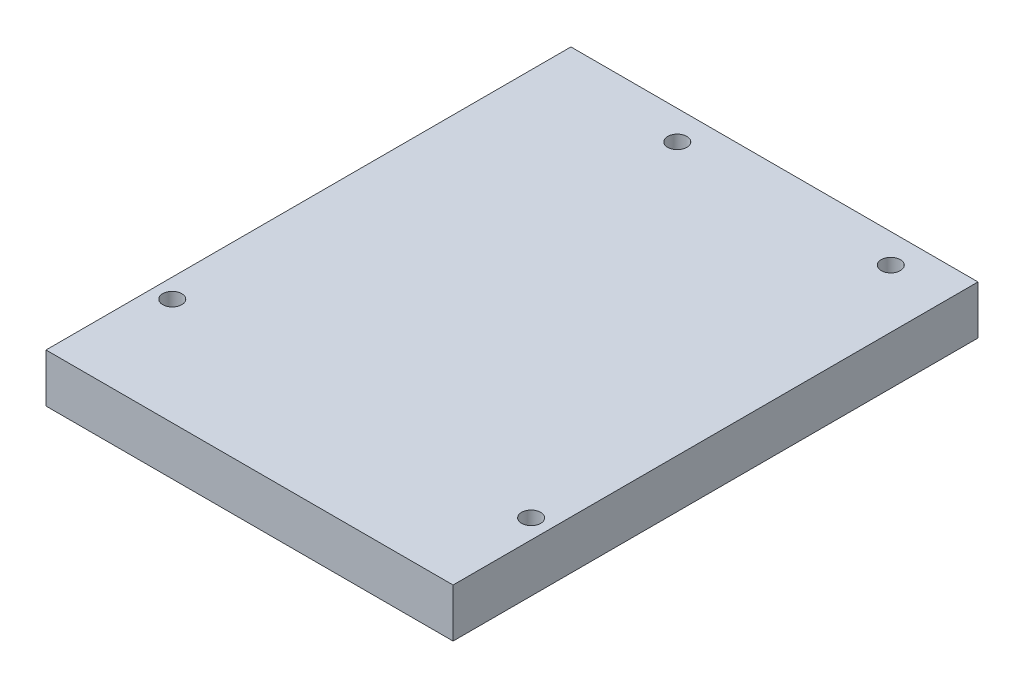
ISO-10303-21;
HEADER;
FILE_DESCRIPTION(('STEP AP214'),'2;1');
FILE_NAME('part.step','',(''),(''),'','','');
FILE_SCHEMA(('AUTOMOTIVE_DESIGN { 1 0 10303 214 1 1 1 1 }'));
ENDSEC;
DATA;
#1=APPLICATION_CONTEXT('core data for automotive mechanical design processes');
#2=APPLICATION_PROTOCOL_DEFINITION('international standard','automotive_design',2000,#1);
#3=PRODUCT_CONTEXT('',#1,'mechanical');
#4=PRODUCT('Part','Part','',(#3));
#5=PRODUCT_RELATED_PRODUCT_CATEGORY('part','',(#4));
#6=PRODUCT_DEFINITION_FORMATION('','',#4);
#7=PRODUCT_DEFINITION_CONTEXT('part definition',#1,'design');
#8=PRODUCT_DEFINITION('design','',#6,#7);
#9=PRODUCT_DEFINITION_SHAPE('','',#8);
#10=(LENGTH_UNIT() NAMED_UNIT(*) SI_UNIT(.MILLI.,.METRE.));
#11=(NAMED_UNIT(*) PLANE_ANGLE_UNIT() SI_UNIT($,.RADIAN.));
#12=(NAMED_UNIT(*) SI_UNIT($,.STERADIAN.) SOLID_ANGLE_UNIT());
#13=UNCERTAINTY_MEASURE_WITH_UNIT(LENGTH_MEASURE(1.E-05),#10,'distance_accuracy_value','');
#14=(GEOMETRIC_REPRESENTATION_CONTEXT(3) GLOBAL_UNCERTAINTY_ASSIGNED_CONTEXT((#13)) GLOBAL_UNIT_ASSIGNED_CONTEXT((#10,
#11,#12)) REPRESENTATION_CONTEXT('',''));
#15=CARTESIAN_POINT('',(0.,0.,0.));
#16=DIRECTION('',(0.,0.,1.));
#17=DIRECTION('',(1.,0.,0.));
#18=AXIS2_PLACEMENT_3D('',#15,#16,#17);
#19=CARTESIAN_POINT('',(0.,6.35,0.));
#20=DIRECTION('',(0.,1.,0.));
#21=DIRECTION('',(0.,0.,1.));
#22=AXIS2_PLACEMENT_3D('',#19,#20,#21);
#23=PLANE('',#22);
#24=CARTESIAN_POINT('',(-50.7,6.35,-14.));
#25=DIRECTION('',(0.,1.,0.));
#26=DIRECTION('',(0.,0.,1.));
#27=AXIS2_PLACEMENT_3D('',#24,#25,#26);
#28=CIRCLE('',#27,1.25000000000001);
#29=CARTESIAN_POINT('',(-50.7,6.35,-12.75));
#30=VERTEX_POINT('',#29);
#31=EDGE_CURVE('E121',#30,#30,#28,.T.);
#32=ORIENTED_EDGE('',*,*,#31,.F.);
#33=EDGE_LOOP('',(#32));
#34=FACE_BOUND('',#33,.T.);
#35=CARTESIAN_POINT('',(-35.5,6.35,-64.8));
#36=DIRECTION('',(0.,1.,0.));
#37=DIRECTION('',(0.,0.,1.));
#38=AXIS2_PLACEMENT_3D('',#35,#36,#37);
#39=CIRCLE('',#38,1.25);
#40=CARTESIAN_POINT('',(-35.5,6.35,-63.55));
#41=VERTEX_POINT('',#40);
#42=EDGE_CURVE('E100',#41,#41,#39,.T.);
#43=ORIENTED_EDGE('',*,*,#42,.F.);
#44=EDGE_LOOP('',(#43));
#45=FACE_BOUND('',#44,.T.);
#46=DIRECTION('',(0.,0.,1.));
#47=VECTOR('',#46,1.);
#48=CARTESIAN_POINT('',(-53.2,6.35,-68.6));
#49=LINE('',#48,#47);
#50=CARTESIAN_POINT('',(-53.2,6.35,-68.6));
#51=VERTEX_POINT('',#50);
#52=CARTESIAN_POINT('',(-53.2,6.35,0.));
#53=VERTEX_POINT('',#52);
#54=EDGE_CURVE('E85',#51,#53,#49,.T.);
#55=ORIENTED_EDGE('',*,*,#54,.T.);
#56=DIRECTION('',(1.,0.,0.));
#57=VECTOR('',#56,1.);
#58=CARTESIAN_POINT('',(-53.2,6.35,0.));
#59=LINE('',#58,#57);
#60=CARTESIAN_POINT('',(0.,6.35,0.));
#61=VERTEX_POINT('',#60);
#62=EDGE_CURVE('E80',#53,#61,#59,.T.);
#63=ORIENTED_EDGE('',*,*,#62,.T.);
#64=DIRECTION('',(0.,0.,-1.));
#65=VECTOR('',#64,1.);
#66=CARTESIAN_POINT('',(0.,6.35,-68.6));
#67=LINE('',#66,#65);
#68=CARTESIAN_POINT('',(0.,6.35,-68.6));
#69=VERTEX_POINT('',#68);
#70=EDGE_CURVE('E83',#61,#69,#67,.T.);
#71=ORIENTED_EDGE('',*,*,#70,.T.);
#72=DIRECTION('',(-1.,0.,0.));
#73=VECTOR('',#72,1.);
#74=CARTESIAN_POINT('',(-53.2,6.35,-68.6));
#75=LINE('',#74,#73);
#76=EDGE_CURVE('E50',#69,#51,#75,.T.);
#77=ORIENTED_EDGE('',*,*,#76,.T.);
#78=EDGE_LOOP('',(#55,#63,#71,#77));
#79=FACE_BOUND('',#78,.T.);
#80=CARTESIAN_POINT('',(-7.60000000000002,6.35,-64.8));
#81=DIRECTION('',(0.,1.,0.));
#82=DIRECTION('',(0.,0.,1.));
#83=AXIS2_PLACEMENT_3D('',#80,#81,#82);
#84=CIRCLE('',#83,1.25);
#85=CARTESIAN_POINT('',(-7.60000000000002,6.35,-63.55));
#86=VERTEX_POINT('',#85);
#87=EDGE_CURVE('E115',#86,#86,#84,.T.);
#88=ORIENTED_EDGE('',*,*,#87,.F.);
#89=EDGE_LOOP('',(#88));
#90=FACE_BOUND('',#89,.T.);
#91=CARTESIAN_POINT('',(-2.5,6.35,-12.7));
#92=DIRECTION('',(0.,1.,0.));
#93=DIRECTION('',(0.,0.,1.));
#94=AXIS2_PLACEMENT_3D('',#91,#92,#93);
#95=CIRCLE('',#94,1.25);
#96=CARTESIAN_POINT('',(-2.5,6.35,-11.45));
#97=VERTEX_POINT('',#96);
#98=EDGE_CURVE('E127',#97,#97,#95,.T.);
#99=ORIENTED_EDGE('',*,*,#98,.F.);
#100=EDGE_LOOP('',(#99));
#101=FACE_BOUND('',#100,.T.);
#102=ADVANCED_FACE('F33',(#34,#45,#79,#90,#101),#23,.T.);
#103=CARTESIAN_POINT('',(0.,0.,0.));
#104=DIRECTION('',(0.,1.,0.));
#105=DIRECTION('',(0.,0.,1.));
#106=AXIS2_PLACEMENT_3D('',#103,#104,#105);
#107=PLANE('',#106);
#108=CARTESIAN_POINT('',(-50.7,0.,-14.));
#109=DIRECTION('',(0.,1.,0.));
#110=DIRECTION('',(0.,0.,1.));
#111=AXIS2_PLACEMENT_3D('',#108,#109,#110);
#112=CIRCLE('',#111,1.25000000000001);
#113=CARTESIAN_POINT('',(-50.7,0.,-12.75));
#114=VERTEX_POINT('',#113);
#115=EDGE_CURVE('E124',#114,#114,#112,.T.);
#116=ORIENTED_EDGE('',*,*,#115,.T.);
#117=EDGE_LOOP('',(#116));
#118=FACE_BOUND('',#117,.T.);
#119=CARTESIAN_POINT('',(-35.5,0.,-64.8));
#120=DIRECTION('',(0.,1.,0.));
#121=DIRECTION('',(0.,0.,1.));
#122=AXIS2_PLACEMENT_3D('',#119,#120,#121);
#123=CIRCLE('',#122,1.25);
#124=CARTESIAN_POINT('',(-35.5,0.,-63.55));
#125=VERTEX_POINT('',#124);
#126=EDGE_CURVE('E112',#125,#125,#123,.T.);
#127=ORIENTED_EDGE('',*,*,#126,.T.);
#128=EDGE_LOOP('',(#127));
#129=FACE_BOUND('',#128,.T.);
#130=DIRECTION('',(0.,0.,1.));
#131=VECTOR('',#130,1.);
#132=CARTESIAN_POINT('',(-53.2,0.,-68.6));
#133=LINE('',#132,#131);
#134=CARTESIAN_POINT('',(-53.2,0.,-68.6));
#135=VERTEX_POINT('',#134);
#136=CARTESIAN_POINT('',(-53.2,0.,0.));
#137=VERTEX_POINT('',#136);
#138=EDGE_CURVE('E97',#135,#137,#133,.T.);
#139=ORIENTED_EDGE('',*,*,#138,.F.);
#140=DIRECTION('',(-1.,0.,0.));
#141=VECTOR('',#140,1.);
#142=CARTESIAN_POINT('',(-53.2,0.,-68.6));
#143=LINE('',#142,#141);
#144=CARTESIAN_POINT('',(0.,0.,-68.6));
#145=VERTEX_POINT('',#144);
#146=EDGE_CURVE('E73',#145,#135,#143,.T.);
#147=ORIENTED_EDGE('',*,*,#146,.F.);
#148=DIRECTION('',(0.,0.,-1.));
#149=VECTOR('',#148,1.);
#150=CARTESIAN_POINT('',(0.,0.,-68.6));
#151=LINE('',#150,#149);
#152=CARTESIAN_POINT('',(0.,0.,0.));
#153=VERTEX_POINT('',#152);
#154=EDGE_CURVE('E67',#153,#145,#151,.T.);
#155=ORIENTED_EDGE('',*,*,#154,.F.);
#156=DIRECTION('',(1.,0.,0.));
#157=VECTOR('',#156,1.);
#158=CARTESIAN_POINT('',(-53.2,0.,0.));
#159=LINE('',#158,#157);
#160=EDGE_CURVE('E89',#137,#153,#159,.T.);
#161=ORIENTED_EDGE('',*,*,#160,.F.);
#162=EDGE_LOOP('',(#139,#147,#155,#161));
#163=FACE_BOUND('',#162,.T.);
#164=CARTESIAN_POINT('',(-7.60000000000002,0.,-64.8));
#165=DIRECTION('',(0.,1.,0.));
#166=DIRECTION('',(0.,0.,1.));
#167=AXIS2_PLACEMENT_3D('',#164,#165,#166);
#168=CIRCLE('',#167,1.25);
#169=CARTESIAN_POINT('',(-7.60000000000002,0.,-63.55));
#170=VERTEX_POINT('',#169);
#171=EDGE_CURVE('E118',#170,#170,#168,.T.);
#172=ORIENTED_EDGE('',*,*,#171,.T.);
#173=EDGE_LOOP('',(#172));
#174=FACE_BOUND('',#173,.T.);
#175=CARTESIAN_POINT('',(-2.5,0.,-12.7));
#176=DIRECTION('',(0.,1.,0.));
#177=DIRECTION('',(0.,0.,1.));
#178=AXIS2_PLACEMENT_3D('',#175,#176,#177);
#179=CIRCLE('',#178,1.25);
#180=CARTESIAN_POINT('',(-2.5,0.,-11.45));
#181=VERTEX_POINT('',#180);
#182=EDGE_CURVE('E130',#181,#181,#179,.T.);
#183=ORIENTED_EDGE('',*,*,#182,.T.);
#184=EDGE_LOOP('',(#183));
#185=FACE_BOUND('',#184,.T.);
#186=ADVANCED_FACE('F108',(#118,#129,#163,#174,#185),#107,.F.);
#187=CARTESIAN_POINT('',(-53.2,6.35,-68.6));
#188=DIRECTION('',(1.,0.,0.));
#189=DIRECTION('',(0.,0.,-1.));
#190=AXIS2_PLACEMENT_3D('',#187,#188,#189);
#191=PLANE('',#190);
#192=ORIENTED_EDGE('',*,*,#138,.T.);
#193=DIRECTION('',(0.,-1.,0.));
#194=VECTOR('',#193,1.);
#195=CARTESIAN_POINT('',(-53.2,6.35,0.));
#196=LINE('',#195,#194);
#197=EDGE_CURVE('E11',#53,#137,#196,.T.);
#198=ORIENTED_EDGE('',*,*,#197,.F.);
#199=ORIENTED_EDGE('',*,*,#54,.F.);
#200=DIRECTION('',(0.,-1.,0.));
#201=VECTOR('',#200,1.);
#202=CARTESIAN_POINT('',(-53.2,6.35,-68.6));
#203=LINE('',#202,#201);
#204=EDGE_CURVE('E93',#51,#135,#203,.T.);
#205=ORIENTED_EDGE('',*,*,#204,.T.);
#206=EDGE_LOOP('',(#192,#198,#199,#205));
#207=FACE_BOUND('',#206,.T.);
#208=ADVANCED_FACE('F35',(#207),#191,.F.);
#209=CARTESIAN_POINT('',(-53.2,6.35,0.));
#210=DIRECTION('',(0.,0.,-1.));
#211=DIRECTION('',(-1.,0.,0.));
#212=AXIS2_PLACEMENT_3D('',#209,#210,#211);
#213=PLANE('',#212);
#214=ORIENTED_EDGE('',*,*,#160,.T.);
#215=DIRECTION('',(0.,-1.,0.));
#216=VECTOR('',#215,1.);
#217=CARTESIAN_POINT('',(0.,6.35,0.));
#218=LINE('',#217,#216);
#219=EDGE_CURVE('E42',#61,#153,#218,.T.);
#220=ORIENTED_EDGE('',*,*,#219,.F.);
#221=ORIENTED_EDGE('',*,*,#62,.F.);
#222=ORIENTED_EDGE('',*,*,#197,.T.);
#223=EDGE_LOOP('',(#214,#220,#221,#222));
#224=FACE_BOUND('',#223,.T.);
#225=ADVANCED_FACE('F88',(#224),#213,.F.);
#226=CARTESIAN_POINT('',(0.,6.35,-68.6));
#227=DIRECTION('',(-1.,0.,0.));
#228=DIRECTION('',(0.,0.,1.));
#229=AXIS2_PLACEMENT_3D('',#226,#227,#228);
#230=PLANE('',#229);
#231=ORIENTED_EDGE('',*,*,#154,.T.);
#232=DIRECTION('',(0.,-1.,0.));
#233=VECTOR('',#232,1.);
#234=CARTESIAN_POINT('',(0.,6.35,-68.6));
#235=LINE('',#234,#233);
#236=EDGE_CURVE('E90',#69,#145,#235,.T.);
#237=ORIENTED_EDGE('',*,*,#236,.F.);
#238=ORIENTED_EDGE('',*,*,#70,.F.);
#239=ORIENTED_EDGE('',*,*,#219,.T.);
#240=EDGE_LOOP('',(#231,#237,#238,#239));
#241=FACE_BOUND('',#240,.T.);
#242=ADVANCED_FACE('F91',(#241),#230,.F.);
#243=CARTESIAN_POINT('',(-53.2,6.35,-68.6));
#244=DIRECTION('',(0.,0.,1.));
#245=DIRECTION('',(1.,0.,0.));
#246=AXIS2_PLACEMENT_3D('',#243,#244,#245);
#247=PLANE('',#246);
#248=ORIENTED_EDGE('',*,*,#146,.T.);
#249=ORIENTED_EDGE('',*,*,#204,.F.);
#250=ORIENTED_EDGE('',*,*,#76,.F.);
#251=ORIENTED_EDGE('',*,*,#236,.T.);
#252=EDGE_LOOP('',(#248,#249,#250,#251));
#253=FACE_BOUND('',#252,.T.);
#254=ADVANCED_FACE('F105',(#253),#247,.F.);
#255=CARTESIAN_POINT('',(-35.5,6.35,-64.8));
#256=DIRECTION('',(0.,-1.,0.));
#257=DIRECTION('',(0.,0.,-1.));
#258=AXIS2_PLACEMENT_3D('',#255,#256,#257);
#259=CYLINDRICAL_SURFACE('',#258,1.25);
#260=ORIENTED_EDGE('',*,*,#42,.T.);
#261=EDGE_LOOP('',(#260));
#262=FACE_BOUND('',#261,.T.);
#263=ORIENTED_EDGE('',*,*,#126,.F.);
#264=EDGE_LOOP('',(#263));
#265=FACE_BOUND('',#264,.T.);
#266=ADVANCED_FACE('F150',(#262,#265),#259,.F.);
#267=CARTESIAN_POINT('',(-7.60000000000002,6.35,-64.8));
#268=DIRECTION('',(0.,-1.,0.));
#269=DIRECTION('',(0.,0.,-1.));
#270=AXIS2_PLACEMENT_3D('',#267,#268,#269);
#271=CYLINDRICAL_SURFACE('',#270,1.25);
#272=ORIENTED_EDGE('',*,*,#87,.T.);
#273=EDGE_LOOP('',(#272));
#274=FACE_BOUND('',#273,.T.);
#275=ORIENTED_EDGE('',*,*,#171,.F.);
#276=EDGE_LOOP('',(#275));
#277=FACE_BOUND('',#276,.T.);
#278=ADVANCED_FACE('F196',(#274,#277),#271,.F.);
#279=CARTESIAN_POINT('',(-50.7,6.35,-14.));
#280=DIRECTION('',(0.,-1.,0.));
#281=DIRECTION('',(0.,0.,-1.));
#282=AXIS2_PLACEMENT_3D('',#279,#280,#281);
#283=CYLINDRICAL_SURFACE('',#282,1.25000000000001);
#284=ORIENTED_EDGE('',*,*,#31,.T.);
#285=EDGE_LOOP('',(#284));
#286=FACE_BOUND('',#285,.T.);
#287=ORIENTED_EDGE('',*,*,#115,.F.);
#288=EDGE_LOOP('',(#287));
#289=FACE_BOUND('',#288,.T.);
#290=ADVANCED_FACE('F204',(#286,#289),#283,.F.);
#291=CARTESIAN_POINT('',(-2.5,6.35,-12.7));
#292=DIRECTION('',(0.,-1.,0.));
#293=DIRECTION('',(0.,0.,-1.));
#294=AXIS2_PLACEMENT_3D('',#291,#292,#293);
#295=CYLINDRICAL_SURFACE('',#294,1.25);
#296=ORIENTED_EDGE('',*,*,#98,.T.);
#297=EDGE_LOOP('',(#296));
#298=FACE_BOUND('',#297,.T.);
#299=ORIENTED_EDGE('',*,*,#182,.F.);
#300=EDGE_LOOP('',(#299));
#301=FACE_BOUND('',#300,.T.);
#302=ADVANCED_FACE('F136',(#298,#301),#295,.F.);
#303=CLOSED_SHELL('',(#102,#186,#208,#225,#242,#254,#266,#278,#290,#302));
#304=MANIFOLD_SOLID_BREP('B2',#303);
#305=ADVANCED_BREP_SHAPE_REPRESENTATION('',(#18,#304),#14);
#306=SHAPE_DEFINITION_REPRESENTATION(#9,#305);
ENDSEC;
END-ISO-10303-21;
